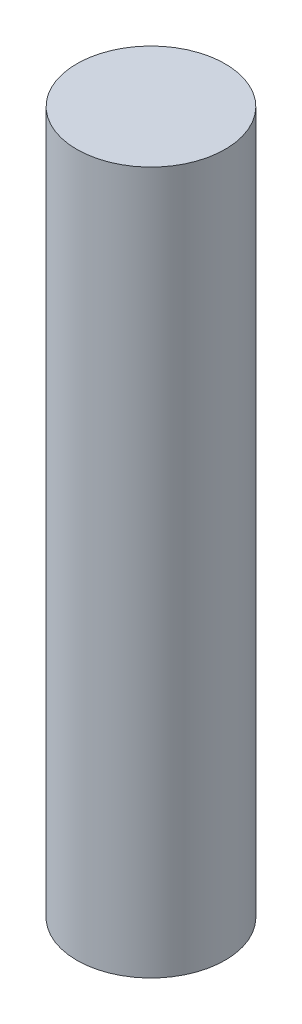
ISO-10303-21;
HEADER;
FILE_DESCRIPTION(('STEP AP214'),'2;1');
FILE_NAME('part.step','',(''),(''),'','','');
FILE_SCHEMA(('AUTOMOTIVE_DESIGN { 1 0 10303 214 1 1 1 1 }'));
ENDSEC;
DATA;
#1=APPLICATION_CONTEXT('core data for automotive mechanical design processes');
#2=APPLICATION_PROTOCOL_DEFINITION('international standard','automotive_design',2000,#1);
#3=PRODUCT_CONTEXT('',#1,'mechanical');
#4=PRODUCT('Part','Part','',(#3));
#5=PRODUCT_RELATED_PRODUCT_CATEGORY('part','',(#4));
#6=PRODUCT_DEFINITION_FORMATION('','',#4);
#7=PRODUCT_DEFINITION_CONTEXT('part definition',#1,'design');
#8=PRODUCT_DEFINITION('design','',#6,#7);
#9=PRODUCT_DEFINITION_SHAPE('','',#8);
#10=(LENGTH_UNIT() NAMED_UNIT(*) SI_UNIT(.MILLI.,.METRE.));
#11=(NAMED_UNIT(*) PLANE_ANGLE_UNIT() SI_UNIT($,.RADIAN.));
#12=(NAMED_UNIT(*) SI_UNIT($,.STERADIAN.) SOLID_ANGLE_UNIT());
#13=UNCERTAINTY_MEASURE_WITH_UNIT(LENGTH_MEASURE(1.E-05),#10,'distance_accuracy_value','');
#14=(GEOMETRIC_REPRESENTATION_CONTEXT(3) GLOBAL_UNCERTAINTY_ASSIGNED_CONTEXT((#13)) GLOBAL_UNIT_ASSIGNED_CONTEXT((#10,
#11,#12)) REPRESENTATION_CONTEXT('',''));
#15=CARTESIAN_POINT('',(0.,0.,0.));
#16=DIRECTION('',(0.,0.,1.));
#17=DIRECTION('',(1.,0.,0.));
#18=AXIS2_PLACEMENT_3D('',#15,#16,#17);
#19=CARTESIAN_POINT('',(0.,304.8,0.));
#20=DIRECTION('',(0.,-1.,0.));
#21=DIRECTION('',(0.,0.,-1.));
#22=AXIS2_PLACEMENT_3D('',#19,#20,#21);
#23=CYLINDRICAL_SURFACE('',#22,32.1945);
#24=CARTESIAN_POINT('',(0.,304.8,0.));
#25=DIRECTION('',(0.,1.,0.));
#26=DIRECTION('',(0.,0.,1.));
#27=AXIS2_PLACEMENT_3D('',#24,#25,#26);
#28=CIRCLE('',#27,32.1945);
#29=CARTESIAN_POINT('',(0.,304.8,32.1945));
#30=VERTEX_POINT('',#29);
#31=EDGE_CURVE('E10',#30,#30,#28,.T.);
#32=ORIENTED_EDGE('',*,*,#31,.F.);
#33=EDGE_LOOP('',(#32));
#34=FACE_BOUND('',#33,.T.);
#35=CARTESIAN_POINT('',(0.,0.,0.));
#36=DIRECTION('',(0.,1.,0.));
#37=DIRECTION('',(0.,0.,1.));
#38=AXIS2_PLACEMENT_3D('',#35,#36,#37);
#39=CIRCLE('',#38,32.1945);
#40=CARTESIAN_POINT('',(0.,0.,32.1945));
#41=VERTEX_POINT('',#40);
#42=EDGE_CURVE('E34',#41,#41,#39,.T.);
#43=ORIENTED_EDGE('',*,*,#42,.T.);
#44=EDGE_LOOP('',(#43));
#45=FACE_BOUND('',#44,.T.);
#46=ADVANCED_FACE('F31',(#34,#45),#23,.T.);
#47=CARTESIAN_POINT('',(0.,304.8,0.));
#48=DIRECTION('',(0.,1.,0.));
#49=DIRECTION('',(0.,0.,1.));
#50=AXIS2_PLACEMENT_3D('',#47,#48,#49);
#51=PLANE('',#50);
#52=ORIENTED_EDGE('',*,*,#31,.T.);
#53=EDGE_LOOP('',(#52));
#54=FACE_BOUND('',#53,.T.);
#55=ADVANCED_FACE('F46',(#54),#51,.T.);
#56=CARTESIAN_POINT('',(0.,0.,0.));
#57=DIRECTION('',(0.,1.,0.));
#58=DIRECTION('',(0.,0.,1.));
#59=AXIS2_PLACEMENT_3D('',#56,#57,#58);
#60=PLANE('',#59);
#61=ORIENTED_EDGE('',*,*,#42,.F.);
#62=EDGE_LOOP('',(#61));
#63=FACE_BOUND('',#62,.T.);
#64=ADVANCED_FACE('F44',(#63),#60,.F.);
#65=CLOSED_SHELL('',(#46,#55,#64));
#66=MANIFOLD_SOLID_BREP('B2',#65);
#67=ADVANCED_BREP_SHAPE_REPRESENTATION('',(#18,#66),#14);
#68=SHAPE_DEFINITION_REPRESENTATION(#9,#67);
ENDSEC;
END-ISO-10303-21;
